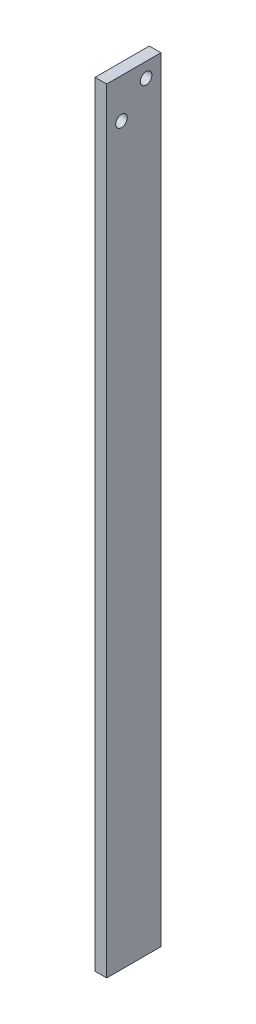
ISO-10303-21;
HEADER;
FILE_DESCRIPTION(('STEP AP214'),'2;1');
FILE_NAME('part.step','',(''),(''),'','','');
FILE_SCHEMA(('AUTOMOTIVE_DESIGN { 1 0 10303 214 1 1 1 1 }'));
ENDSEC;
DATA;
#1=APPLICATION_CONTEXT('core data for automotive mechanical design processes');
#2=APPLICATION_PROTOCOL_DEFINITION('international standard','automotive_design',2000,#1);
#3=PRODUCT_CONTEXT('',#1,'mechanical');
#4=PRODUCT('Part','Part','',(#3));
#5=PRODUCT_RELATED_PRODUCT_CATEGORY('part','',(#4));
#6=PRODUCT_DEFINITION_FORMATION('','',#4);
#7=PRODUCT_DEFINITION_CONTEXT('part definition',#1,'design');
#8=PRODUCT_DEFINITION('design','',#6,#7);
#9=PRODUCT_DEFINITION_SHAPE('','',#8);
#10=(LENGTH_UNIT() NAMED_UNIT(*) SI_UNIT(.MILLI.,.METRE.));
#11=(NAMED_UNIT(*) PLANE_ANGLE_UNIT() SI_UNIT($,.RADIAN.));
#12=(NAMED_UNIT(*) SI_UNIT($,.STERADIAN.) SOLID_ANGLE_UNIT());
#13=UNCERTAINTY_MEASURE_WITH_UNIT(LENGTH_MEASURE(1.E-05),#10,'distance_accuracy_value','');
#14=(GEOMETRIC_REPRESENTATION_CONTEXT(3) GLOBAL_UNCERTAINTY_ASSIGNED_CONTEXT((#13)) GLOBAL_UNIT_ASSIGNED_CONTEXT((#10,
#11,#12)) REPRESENTATION_CONTEXT('',''));
#15=CARTESIAN_POINT('',(0.,0.,0.));
#16=DIRECTION('',(0.,0.,1.));
#17=DIRECTION('',(1.,0.,0.));
#18=AXIS2_PLACEMENT_3D('',#15,#16,#17);
#19=CARTESIAN_POINT('',(3.,0.,0.));
#20=DIRECTION('',(1.,0.,0.));
#21=DIRECTION('',(0.,0.,-1.));
#22=AXIS2_PLACEMENT_3D('',#19,#20,#21);
#23=PLANE('',#22);
#24=CARTESIAN_POINT('',(3.,-3.81801948466054,-10.1819805153395));
#25=DIRECTION('',(1.,0.,0.));
#26=DIRECTION('',(0.,0.,-1.));
#27=AXIS2_PLACEMENT_3D('',#24,#25,#26);
#28=CIRCLE('',#27,1.5);
#29=CARTESIAN_POINT('',(3.,-3.81801948466054,-11.6819805153395));
#30=VERTEX_POINT('',#29);
#31=EDGE_CURVE('E102',#30,#30,#28,.T.);
#32=ORIENTED_EDGE('',*,*,#31,.F.);
#33=EDGE_LOOP('',(#32));
#34=FACE_BOUND('',#33,.T.);
#35=DIRECTION('',(0.,-1.,0.));
#36=VECTOR('',#35,1.);
#37=CARTESIAN_POINT('',(3.,0.,0.));
#38=LINE('',#37,#36);
#39=CARTESIAN_POINT('',(3.,0.,0.));
#40=VERTEX_POINT('',#39);
#41=CARTESIAN_POINT('',(3.,-200.,0.));
#42=VERTEX_POINT('',#41);
#43=EDGE_CURVE('E87',#40,#42,#38,.T.);
#44=ORIENTED_EDGE('',*,*,#43,.T.);
#45=DIRECTION('',(0.,0.,-1.));
#46=VECTOR('',#45,1.);
#47=CARTESIAN_POINT('',(3.,-200.,0.));
#48=LINE('',#47,#46);
#49=CARTESIAN_POINT('',(3.,-200.,-14.));
#50=VERTEX_POINT('',#49);
#51=EDGE_CURVE('E82',#42,#50,#48,.T.);
#52=ORIENTED_EDGE('',*,*,#51,.T.);
#53=DIRECTION('',(0.,1.,0.));
#54=VECTOR('',#53,1.);
#55=CARTESIAN_POINT('',(3.,0.,-14.));
#56=LINE('',#55,#54);
#57=CARTESIAN_POINT('',(3.,0.,-14.));
#58=VERTEX_POINT('',#57);
#59=EDGE_CURVE('E85',#50,#58,#56,.T.);
#60=ORIENTED_EDGE('',*,*,#59,.T.);
#61=DIRECTION('',(0.,0.,1.));
#62=VECTOR('',#61,1.);
#63=CARTESIAN_POINT('',(3.,0.,0.));
#64=LINE('',#63,#62);
#65=EDGE_CURVE('E52',#58,#40,#64,.T.);
#66=ORIENTED_EDGE('',*,*,#65,.T.);
#67=EDGE_LOOP('',(#44,#52,#60,#66));
#68=FACE_BOUND('',#67,.T.);
#69=CARTESIAN_POINT('',(3.,-10.1819805153395,-3.81801948466054));
#70=DIRECTION('',(1.,0.,0.));
#71=DIRECTION('',(0.,0.,-1.));
#72=AXIS2_PLACEMENT_3D('',#69,#70,#71);
#73=CIRCLE('',#72,1.5);
#74=CARTESIAN_POINT('',(3.,-10.1819805153395,-5.31801948466054));
#75=VERTEX_POINT('',#74);
#76=EDGE_CURVE('E117',#75,#75,#73,.T.);
#77=ORIENTED_EDGE('',*,*,#76,.F.);
#78=EDGE_LOOP('',(#77));
#79=FACE_BOUND('',#78,.T.);
#80=ADVANCED_FACE('F35',(#34,#68,#79),#23,.T.);
#81=CARTESIAN_POINT('',(0.,0.,0.));
#82=DIRECTION('',(1.,0.,0.));
#83=DIRECTION('',(0.,0.,-1.));
#84=AXIS2_PLACEMENT_3D('',#81,#82,#83);
#85=PLANE('',#84);
#86=DIRECTION('',(0.,-1.,0.));
#87=VECTOR('',#86,1.);
#88=CARTESIAN_POINT('',(0.,0.,0.));
#89=LINE('',#88,#87);
#90=CARTESIAN_POINT('',(0.,0.,0.));
#91=VERTEX_POINT('',#90);
#92=CARTESIAN_POINT('',(0.,-200.,0.));
#93=VERTEX_POINT('',#92);
#94=EDGE_CURVE('E99',#91,#93,#89,.T.);
#95=ORIENTED_EDGE('',*,*,#94,.F.);
#96=DIRECTION('',(0.,0.,1.));
#97=VECTOR('',#96,1.);
#98=CARTESIAN_POINT('',(0.,0.,0.));
#99=LINE('',#98,#97);
#100=CARTESIAN_POINT('',(0.,0.,-14.));
#101=VERTEX_POINT('',#100);
#102=EDGE_CURVE('E75',#101,#91,#99,.T.);
#103=ORIENTED_EDGE('',*,*,#102,.F.);
#104=DIRECTION('',(0.,1.,0.));
#105=VECTOR('',#104,1.);
#106=CARTESIAN_POINT('',(0.,0.,-14.));
#107=LINE('',#106,#105);
#108=CARTESIAN_POINT('',(0.,-200.,-14.));
#109=VERTEX_POINT('',#108);
#110=EDGE_CURVE('E69',#109,#101,#107,.T.);
#111=ORIENTED_EDGE('',*,*,#110,.F.);
#112=DIRECTION('',(0.,0.,-1.));
#113=VECTOR('',#112,1.);
#114=CARTESIAN_POINT('',(0.,-200.,0.));
#115=LINE('',#114,#113);
#116=EDGE_CURVE('E91',#93,#109,#115,.T.);
#117=ORIENTED_EDGE('',*,*,#116,.F.);
#118=EDGE_LOOP('',(#95,#103,#111,#117));
#119=FACE_BOUND('',#118,.T.);
#120=CARTESIAN_POINT('',(0.,-3.81801948466054,-10.1819805153395));
#121=DIRECTION('',(1.,0.,0.));
#122=DIRECTION('',(0.,0.,-1.));
#123=AXIS2_PLACEMENT_3D('',#120,#121,#122);
#124=CIRCLE('',#123,1.5);
#125=CARTESIAN_POINT('',(0.,-3.81801948466054,-11.6819805153395));
#126=VERTEX_POINT('',#125);
#127=EDGE_CURVE('E114',#126,#126,#124,.T.);
#128=ORIENTED_EDGE('',*,*,#127,.T.);
#129=EDGE_LOOP('',(#128));
#130=FACE_BOUND('',#129,.T.);
#131=CARTESIAN_POINT('',(0.,-10.1819805153395,-3.81801948466054));
#132=DIRECTION('',(1.,0.,0.));
#133=DIRECTION('',(0.,0.,-1.));
#134=AXIS2_PLACEMENT_3D('',#131,#132,#133);
#135=CIRCLE('',#134,1.5);
#136=CARTESIAN_POINT('',(0.,-10.1819805153395,-5.31801948466054));
#137=VERTEX_POINT('',#136);
#138=EDGE_CURVE('E120',#137,#137,#135,.T.);
#139=ORIENTED_EDGE('',*,*,#138,.T.);
#140=EDGE_LOOP('',(#139));
#141=FACE_BOUND('',#140,.T.);
#142=ADVANCED_FACE('F110',(#119,#130,#141),#85,.F.);
#143=CARTESIAN_POINT('',(3.,0.,0.));
#144=DIRECTION('',(0.,0.,-1.));
#145=DIRECTION('',(0.,1.,0.));
#146=AXIS2_PLACEMENT_3D('',#143,#144,#145);
#147=PLANE('',#146);
#148=ORIENTED_EDGE('',*,*,#94,.T.);
#149=DIRECTION('',(-1.,0.,0.));
#150=VECTOR('',#149,1.);
#151=CARTESIAN_POINT('',(3.,-200.,0.));
#152=LINE('',#151,#150);
#153=EDGE_CURVE('E11',#42,#93,#152,.T.);
#154=ORIENTED_EDGE('',*,*,#153,.F.);
#155=ORIENTED_EDGE('',*,*,#43,.F.);
#156=DIRECTION('',(-1.,0.,0.));
#157=VECTOR('',#156,1.);
#158=CARTESIAN_POINT('',(3.,0.,0.));
#159=LINE('',#158,#157);
#160=EDGE_CURVE('E95',#40,#91,#159,.T.);
#161=ORIENTED_EDGE('',*,*,#160,.T.);
#162=EDGE_LOOP('',(#148,#154,#155,#161));
#163=FACE_BOUND('',#162,.T.);
#164=ADVANCED_FACE('F37',(#163),#147,.F.);
#165=CARTESIAN_POINT('',(3.,-200.,0.));
#166=DIRECTION('',(0.,1.,0.));
#167=DIRECTION('',(0.,0.,1.));
#168=AXIS2_PLACEMENT_3D('',#165,#166,#167);
#169=PLANE('',#168);
#170=ORIENTED_EDGE('',*,*,#116,.T.);
#171=DIRECTION('',(-1.,0.,0.));
#172=VECTOR('',#171,1.);
#173=CARTESIAN_POINT('',(3.,-200.,-14.));
#174=LINE('',#173,#172);
#175=EDGE_CURVE('E44',#50,#109,#174,.T.);
#176=ORIENTED_EDGE('',*,*,#175,.F.);
#177=ORIENTED_EDGE('',*,*,#51,.F.);
#178=ORIENTED_EDGE('',*,*,#153,.T.);
#179=EDGE_LOOP('',(#170,#176,#177,#178));
#180=FACE_BOUND('',#179,.T.);
#181=ADVANCED_FACE('F90',(#180),#169,.F.);
#182=CARTESIAN_POINT('',(3.,0.,-14.));
#183=DIRECTION('',(0.,0.,1.));
#184=DIRECTION('',(0.,-1.,0.));
#185=AXIS2_PLACEMENT_3D('',#182,#183,#184);
#186=PLANE('',#185);
#187=ORIENTED_EDGE('',*,*,#110,.T.);
#188=DIRECTION('',(-1.,0.,0.));
#189=VECTOR('',#188,1.);
#190=CARTESIAN_POINT('',(3.,0.,-14.));
#191=LINE('',#190,#189);
#192=EDGE_CURVE('E92',#58,#101,#191,.T.);
#193=ORIENTED_EDGE('',*,*,#192,.F.);
#194=ORIENTED_EDGE('',*,*,#59,.F.);
#195=ORIENTED_EDGE('',*,*,#175,.T.);
#196=EDGE_LOOP('',(#187,#193,#194,#195));
#197=FACE_BOUND('',#196,.T.);
#198=ADVANCED_FACE('F93',(#197),#186,.F.);
#199=CARTESIAN_POINT('',(3.,0.,0.));
#200=DIRECTION('',(0.,-1.,0.));
#201=DIRECTION('',(0.,0.,-1.));
#202=AXIS2_PLACEMENT_3D('',#199,#200,#201);
#203=PLANE('',#202);
#204=ORIENTED_EDGE('',*,*,#102,.T.);
#205=ORIENTED_EDGE('',*,*,#160,.F.);
#206=ORIENTED_EDGE('',*,*,#65,.F.);
#207=ORIENTED_EDGE('',*,*,#192,.T.);
#208=EDGE_LOOP('',(#204,#205,#206,#207));
#209=FACE_BOUND('',#208,.T.);
#210=ADVANCED_FACE('F107',(#209),#203,.F.);
#211=CARTESIAN_POINT('',(3.,-3.81801948466054,-10.1819805153395));
#212=DIRECTION('',(-1.,0.,0.));
#213=DIRECTION('',(0.,0.,1.));
#214=AXIS2_PLACEMENT_3D('',#211,#212,#213);
#215=CYLINDRICAL_SURFACE('',#214,1.5);
#216=ORIENTED_EDGE('',*,*,#31,.T.);
#217=EDGE_LOOP('',(#216));
#218=FACE_BOUND('',#217,.T.);
#219=ORIENTED_EDGE('',*,*,#127,.F.);
#220=EDGE_LOOP('',(#219));
#221=FACE_BOUND('',#220,.T.);
#222=ADVANCED_FACE('F137',(#218,#221),#215,.F.);
#223=CARTESIAN_POINT('',(3.,-10.1819805153395,-3.81801948466054));
#224=DIRECTION('',(-1.,0.,0.));
#225=DIRECTION('',(0.,0.,1.));
#226=AXIS2_PLACEMENT_3D('',#223,#224,#225);
#227=CYLINDRICAL_SURFACE('',#226,1.5);
#228=ORIENTED_EDGE('',*,*,#76,.T.);
#229=EDGE_LOOP('',(#228));
#230=FACE_BOUND('',#229,.T.);
#231=ORIENTED_EDGE('',*,*,#138,.F.);
#232=EDGE_LOOP('',(#231));
#233=FACE_BOUND('',#232,.T.);
#234=ADVANCED_FACE('F126',(#230,#233),#227,.F.);
#235=CLOSED_SHELL('',(#80,#142,#164,#181,#198,#210,#222,#234));
#236=MANIFOLD_SOLID_BREP('B2',#235);
#237=ADVANCED_BREP_SHAPE_REPRESENTATION('',(#18,#236),#14);
#238=SHAPE_DEFINITION_REPRESENTATION(#9,#237);
ENDSEC;
END-ISO-10303-21;
